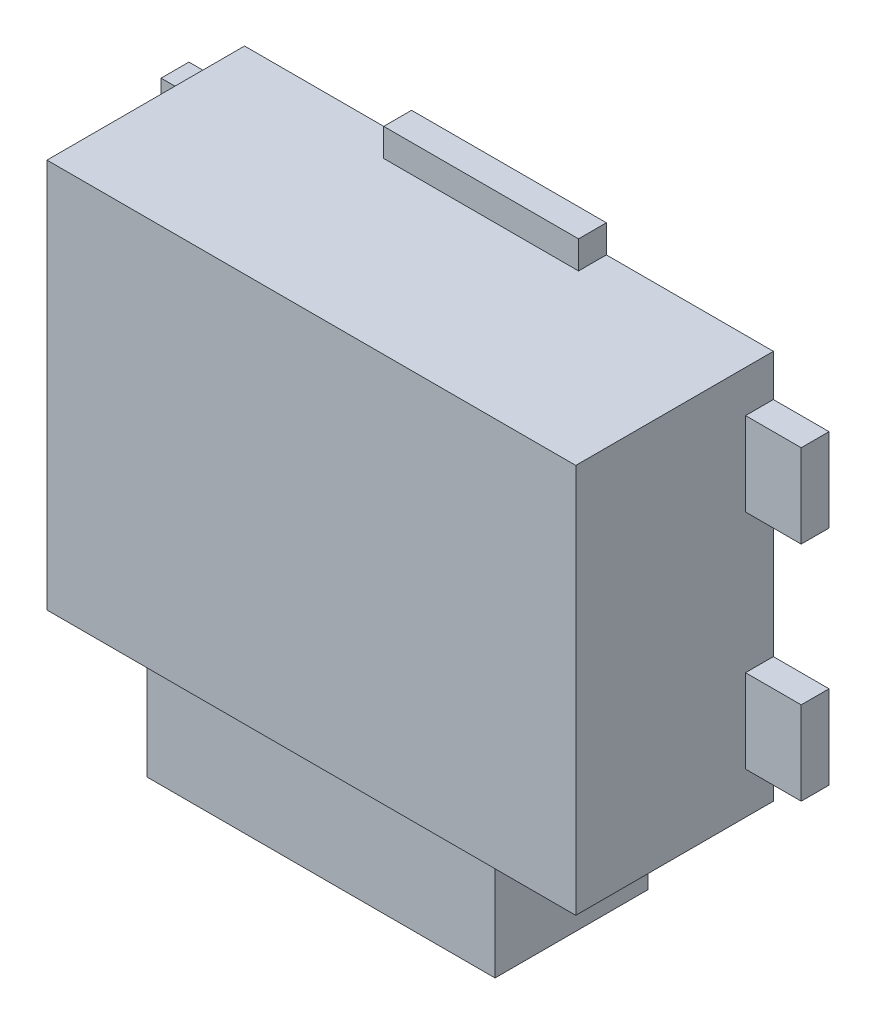
ISO-10303-21;
HEADER;
FILE_DESCRIPTION(('STEP AP214'),'2;1');
FILE_NAME('part.step','',(''),(''),'','','');
FILE_SCHEMA(('AUTOMOTIVE_DESIGN { 1 0 10303 214 1 1 1 1 }'));
ENDSEC;
DATA;
#1=APPLICATION_CONTEXT('core data for automotive mechanical design processes');
#2=APPLICATION_PROTOCOL_DEFINITION('international standard','automotive_design',2000,#1);
#3=PRODUCT_CONTEXT('',#1,'mechanical');
#4=PRODUCT('Part','Part','',(#3));
#5=PRODUCT_RELATED_PRODUCT_CATEGORY('part','',(#4));
#6=PRODUCT_DEFINITION_FORMATION('','',#4);
#7=PRODUCT_DEFINITION_CONTEXT('part definition',#1,'design');
#8=PRODUCT_DEFINITION('design','',#6,#7);
#9=PRODUCT_DEFINITION_SHAPE('','',#8);
#10=(LENGTH_UNIT() NAMED_UNIT(*) SI_UNIT(.MILLI.,.METRE.));
#11=(NAMED_UNIT(*) PLANE_ANGLE_UNIT() SI_UNIT($,.RADIAN.));
#12=(NAMED_UNIT(*) SI_UNIT($,.STERADIAN.) SOLID_ANGLE_UNIT());
#13=UNCERTAINTY_MEASURE_WITH_UNIT(LENGTH_MEASURE(1.E-05),#10,'distance_accuracy_value','');
#14=(GEOMETRIC_REPRESENTATION_CONTEXT(3) GLOBAL_UNCERTAINTY_ASSIGNED_CONTEXT((#13)) GLOBAL_UNIT_ASSIGNED_CONTEXT((#10,
#11,#12)) REPRESENTATION_CONTEXT('',''));
#15=CARTESIAN_POINT('',(0.,0.,0.));
#16=DIRECTION('',(0.,0.,1.));
#17=DIRECTION('',(1.,0.,0.));
#18=AXIS2_PLACEMENT_3D('',#15,#16,#17);
#19=CARTESIAN_POINT('',(1.25,-1.85,0.85));
#20=DIRECTION('',(0.,0.,-1.));
#21=DIRECTION('',(0.,-1.,0.));
#22=AXIS2_PLACEMENT_3D('',#19,#20,#21);
#23=PLANE('',#22);
#24=DIRECTION('',(1.,0.,0.));
#25=VECTOR('',#24,1.);
#26=CARTESIAN_POINT('',(-1.25,-0.4,0.85));
#27=LINE('',#26,#25);
#28=CARTESIAN_POINT('',(-1.25,-0.4,0.85));
#29=VERTEX_POINT('',#28);
#30=CARTESIAN_POINT('',(1.25,-0.4,0.85));
#31=VERTEX_POINT('',#30);
#32=EDGE_CURVE('E27',#29,#31,#27,.T.);
#33=ORIENTED_EDGE('',*,*,#32,.T.);
#34=DIRECTION('',(0.,-1.,0.));
#35=VECTOR('',#34,1.);
#36=CARTESIAN_POINT('',(1.25,-1.85,0.85));
#37=LINE('',#36,#35);
#38=CARTESIAN_POINT('',(1.25,-1.4,0.85));
#39=VERTEX_POINT('',#38);
#40=EDGE_CURVE('E280',#31,#39,#37,.T.);
#41=ORIENTED_EDGE('',*,*,#40,.T.);
#42=DIRECTION('',(0.,-1.,0.));
#43=VECTOR('',#42,1.);
#44=CARTESIAN_POINT('',(1.25,-1.85,0.85));
#45=LINE('',#44,#43);
#46=CARTESIAN_POINT('',(1.25,-1.85,0.85));
#47=VERTEX_POINT('',#46);
#48=EDGE_CURVE('E308',#39,#47,#45,.T.);
#49=ORIENTED_EDGE('',*,*,#48,.T.);
#50=DIRECTION('',(1.,0.,0.));
#51=VECTOR('',#50,1.);
#52=CARTESIAN_POINT('',(1.25,-1.85,0.85));
#53=LINE('',#52,#51);
#54=CARTESIAN_POINT('',(-1.25,-1.85,0.85));
#55=VERTEX_POINT('',#54);
#56=EDGE_CURVE('E11',#55,#47,#53,.T.);
#57=ORIENTED_EDGE('',*,*,#56,.F.);
#58=DIRECTION('',(0.,1.,0.));
#59=VECTOR('',#58,1.);
#60=CARTESIAN_POINT('',(-1.25,-1.85,0.85));
#61=LINE('',#60,#59);
#62=CARTESIAN_POINT('',(-1.25,-1.4,0.85));
#63=VERTEX_POINT('',#62);
#64=EDGE_CURVE('E20',#55,#63,#61,.T.);
#65=ORIENTED_EDGE('',*,*,#64,.T.);
#66=DIRECTION('',(0.,1.,0.));
#67=VECTOR('',#66,1.);
#68=CARTESIAN_POINT('',(-1.25,-1.85,0.85));
#69=LINE('',#68,#67);
#70=EDGE_CURVE('E377',#63,#29,#69,.T.);
#71=ORIENTED_EDGE('',*,*,#70,.T.);
#72=EDGE_LOOP('',(#33,#41,#49,#57,#65,#71));
#73=FACE_BOUND('',#72,.T.);
#74=ADVANCED_FACE('F16',(#73),#23,.T.);
#75=CARTESIAN_POINT('',(1.25,-1.85,0.15));
#76=DIRECTION('',(0.,1.,0.));
#77=DIRECTION('',(0.,0.,-1.));
#78=AXIS2_PLACEMENT_3D('',#75,#76,#77);
#79=PLANE('',#78);
#80=DIRECTION('',(0.,0.,1.));
#81=VECTOR('',#80,1.);
#82=CARTESIAN_POINT('',(-1.25,-1.85,0.15));
#83=LINE('',#82,#81);
#84=CARTESIAN_POINT('',(-1.25,-1.85,0.25));
#85=VERTEX_POINT('',#84);
#86=EDGE_CURVE('E428',#85,#55,#83,.T.);
#87=ORIENTED_EDGE('',*,*,#86,.T.);
#88=ORIENTED_EDGE('',*,*,#56,.T.);
#89=DIRECTION('',(0.,0.,-1.));
#90=VECTOR('',#89,1.);
#91=CARTESIAN_POINT('',(1.25,-1.85,0.15));
#92=LINE('',#91,#90);
#93=CARTESIAN_POINT('',(1.25,-1.85,0.25));
#94=VERTEX_POINT('',#93);
#95=EDGE_CURVE('E313',#47,#94,#92,.T.);
#96=ORIENTED_EDGE('',*,*,#95,.T.);
#97=DIRECTION('',(1.,0.,0.));
#98=VECTOR('',#97,1.);
#99=CARTESIAN_POINT('',(1.25,-1.85,0.25));
#100=LINE('',#99,#98);
#101=EDGE_CURVE('E395',#85,#94,#100,.T.);
#102=ORIENTED_EDGE('',*,*,#101,.F.);
#103=EDGE_LOOP('',(#87,#88,#96,#102));
#104=FACE_BOUND('',#103,.T.);
#105=ADVANCED_FACE('F1223',(#104),#79,.T.);
#106=CARTESIAN_POINT('',(-1.25,-0.4,1.35));
#107=DIRECTION('',(0.,-1.,0.));
#108=DIRECTION('',(-1.,0.,0.));
#109=AXIS2_PLACEMENT_3D('',#106,#107,#108);
#110=PLANE('',#109);
#111=ORIENTED_EDGE('',*,*,#32,.F.);
#112=DIRECTION('',(0.,0.,-1.));
#113=VECTOR('',#112,1.);
#114=CARTESIAN_POINT('',(-1.25,-0.4,1.35));
#115=LINE('',#114,#113);
#116=CARTESIAN_POINT('',(-1.25,-0.4,1.35));
#117=VERTEX_POINT('',#116);
#118=EDGE_CURVE('E373',#117,#29,#115,.T.);
#119=ORIENTED_EDGE('',*,*,#118,.F.);
#120=DIRECTION('',(-1.,0.,0.));
#121=VECTOR('',#120,1.);
#122=CARTESIAN_POINT('',(-1.25,-0.4,1.35));
#123=LINE('',#122,#121);
#124=CARTESIAN_POINT('',(1.25,-0.4,1.35));
#125=VERTEX_POINT('',#124);
#126=EDGE_CURVE('E42',#125,#117,#123,.T.);
#127=ORIENTED_EDGE('',*,*,#126,.F.);
#128=DIRECTION('',(0.,0.,1.));
#129=VECTOR('',#128,1.);
#130=CARTESIAN_POINT('',(1.25,-0.4,1.35));
#131=LINE('',#130,#129);
#132=EDGE_CURVE('E284',#31,#125,#131,.T.);
#133=ORIENTED_EDGE('',*,*,#132,.F.);
#134=EDGE_LOOP('',(#111,#119,#127,#133));
#135=FACE_BOUND('',#134,.T.);
#136=ADVANCED_FACE('F1218',(#135),#110,.F.);
#137=CARTESIAN_POINT('',(1.25,-0.4,0.25));
#138=DIRECTION('',(0.,0.,-1.));
#139=DIRECTION('',(0.,-1.,0.));
#140=AXIS2_PLACEMENT_3D('',#137,#138,#139);
#141=PLANE('',#140);
#142=DIRECTION('',(1.,0.,0.));
#143=VECTOR('',#142,1.);
#144=CARTESIAN_POINT('',(-1.25,-2.15,0.25));
#145=LINE('',#144,#143);
#146=CARTESIAN_POINT('',(-1.25,-2.15,0.25));
#147=VERTEX_POINT('',#146);
#148=CARTESIAN_POINT('',(1.25,-2.15,0.25));
#149=VERTEX_POINT('',#148);
#150=EDGE_CURVE('E456',#147,#149,#145,.T.);
#151=ORIENTED_EDGE('',*,*,#150,.F.);
#152=DIRECTION('',(0.,1.,0.));
#153=VECTOR('',#152,1.);
#154=CARTESIAN_POINT('',(-1.25,-0.4,0.25));
#155=LINE('',#154,#153);
#156=EDGE_CURVE('E423',#147,#85,#155,.T.);
#157=ORIENTED_EDGE('',*,*,#156,.T.);
#158=ORIENTED_EDGE('',*,*,#101,.T.);
#159=DIRECTION('',(0.,-1.,0.));
#160=VECTOR('',#159,1.);
#161=CARTESIAN_POINT('',(1.25,-0.4,0.25));
#162=LINE('',#161,#160);
#163=EDGE_CURVE('E407',#94,#149,#162,.T.);
#164=ORIENTED_EDGE('',*,*,#163,.T.);
#165=EDGE_LOOP('',(#151,#157,#158,#164));
#166=FACE_BOUND('',#165,.T.);
#167=ADVANCED_FACE('F1222',(#166),#141,.T.);
#168=CARTESIAN_POINT('',(-1.25,-1.4,1.35));
#169=DIRECTION('',(0.,0.,-1.));
#170=DIRECTION('',(0.,-1.,0.));
#171=AXIS2_PLACEMENT_3D('',#168,#169,#170);
#172=PLANE('',#171);
#173=DIRECTION('',(-1.,0.,0.));
#174=VECTOR('',#173,1.);
#175=CARTESIAN_POINT('',(-1.25,0.6,1.35));
#176=LINE('',#175,#174);
#177=CARTESIAN_POINT('',(1.25,0.6,1.35));
#178=VERTEX_POINT('',#177);
#179=CARTESIAN_POINT('',(-1.25,0.6,1.35));
#180=VERTEX_POINT('',#179);
#181=EDGE_CURVE('E285',#178,#180,#176,.T.);
#182=ORIENTED_EDGE('',*,*,#181,.F.);
#183=DIRECTION('',(0.,1.,0.));
#184=VECTOR('',#183,1.);
#185=CARTESIAN_POINT('',(1.25,-1.4,1.35));
#186=LINE('',#185,#184);
#187=EDGE_CURVE('E267',#125,#178,#186,.T.);
#188=ORIENTED_EDGE('',*,*,#187,.F.);
#189=ORIENTED_EDGE('',*,*,#126,.T.);
#190=DIRECTION('',(0.,1.,0.));
#191=VECTOR('',#190,1.);
#192=CARTESIAN_POINT('',(-1.25,-1.4,1.35));
#193=LINE('',#192,#191);
#194=EDGE_CURVE('E466',#117,#180,#193,.T.);
#195=ORIENTED_EDGE('',*,*,#194,.T.);
#196=EDGE_LOOP('',(#182,#188,#189,#195));
#197=FACE_BOUND('',#196,.T.);
#198=ADVANCED_FACE('F780',(#197),#172,.T.);
#199=CARTESIAN_POINT('',(-2.3,0.5,0.));
#200=DIRECTION('',(-1.,0.,0.));
#201=DIRECTION('',(0.,0.,1.));
#202=AXIS2_PLACEMENT_3D('',#199,#200,#201);
#203=PLANE('',#202);
#204=DIRECTION('',(0.,0.,1.));
#205=VECTOR('',#204,1.);
#206=CARTESIAN_POINT('',(-2.3,1.1,0.));
#207=LINE('',#206,#205);
#208=CARTESIAN_POINT('',(-2.3,1.1,0.));
#209=VERTEX_POINT('',#208);
#210=CARTESIAN_POINT('',(-2.3,1.1,0.2));
#211=VERTEX_POINT('',#210);
#212=EDGE_CURVE('E378',#209,#211,#207,.T.);
#213=ORIENTED_EDGE('',*,*,#212,.F.);
#214=DIRECTION('',(0.,-1.,0.));
#215=VECTOR('',#214,1.);
#216=CARTESIAN_POINT('',(-2.3,0.5,0.));
#217=LINE('',#216,#215);
#218=CARTESIAN_POINT('',(-2.3,0.5,0.));
#219=VERTEX_POINT('',#218);
#220=EDGE_CURVE('E422',#209,#219,#217,.T.);
#221=ORIENTED_EDGE('',*,*,#220,.T.);
#222=DIRECTION('',(0.,0.,-1.));
#223=VECTOR('',#222,1.);
#224=CARTESIAN_POINT('',(-2.3,0.5,0.));
#225=LINE('',#224,#223);
#226=CARTESIAN_POINT('',(-2.3,0.5,0.2));
#227=VERTEX_POINT('',#226);
#228=EDGE_CURVE('E354',#227,#219,#225,.T.);
#229=ORIENTED_EDGE('',*,*,#228,.F.);
#230=DIRECTION('',(0.,-1.,0.));
#231=VECTOR('',#230,1.);
#232=CARTESIAN_POINT('',(-2.3,1.1,0.2));
#233=LINE('',#232,#231);
#234=EDGE_CURVE('E353',#211,#227,#233,.T.);
#235=ORIENTED_EDGE('',*,*,#234,.F.);
#236=EDGE_LOOP('',(#213,#221,#229,#235));
#237=FACE_BOUND('',#236,.T.);
#238=ADVANCED_FACE('F1149',(#237),#203,.T.);
#239=CARTESIAN_POINT('',(-2.299999999999,-1.1,0.));
#240=DIRECTION('',(-1.,0.,0.));
#241=DIRECTION('',(0.,0.,1.));
#242=AXIS2_PLACEMENT_3D('',#239,#240,#241);
#243=PLANE('',#242);
#244=DIRECTION('',(0.,0.,1.));
#245=VECTOR('',#244,1.);
#246=CARTESIAN_POINT('',(-2.299999999999,-0.5,0.));
#247=LINE('',#246,#245);
#248=CARTESIAN_POINT('',(-2.299999999999,-0.5,0.));
#249=VERTEX_POINT('',#248);
#250=CARTESIAN_POINT('',(-2.299999999999,-0.5,0.2));
#251=VERTEX_POINT('',#250);
#252=EDGE_CURVE('E334',#249,#251,#247,.T.);
#253=ORIENTED_EDGE('',*,*,#252,.F.);
#254=DIRECTION('',(0.,-1.,0.));
#255=VECTOR('',#254,1.);
#256=CARTESIAN_POINT('',(-2.299999999999,-1.1,0.));
#257=LINE('',#256,#255);
#258=CARTESIAN_POINT('',(-2.299999999999,-1.1,0.));
#259=VERTEX_POINT('',#258);
#260=EDGE_CURVE('E383',#249,#259,#257,.T.);
#261=ORIENTED_EDGE('',*,*,#260,.T.);
#262=DIRECTION('',(0.,0.,-1.));
#263=VECTOR('',#262,1.);
#264=CARTESIAN_POINT('',(-2.299999999999,-1.1,0.));
#265=LINE('',#264,#263);
#266=CARTESIAN_POINT('',(-2.299999999999,-1.1,0.2));
#267=VERTEX_POINT('',#266);
#268=EDGE_CURVE('E448',#267,#259,#265,.T.);
#269=ORIENTED_EDGE('',*,*,#268,.F.);
#270=DIRECTION('',(0.,-1.,0.));
#271=VECTOR('',#270,1.);
#272=CARTESIAN_POINT('',(-2.299999999999,-0.5,0.2));
#273=LINE('',#272,#271);
#274=EDGE_CURVE('E331',#251,#267,#273,.T.);
#275=ORIENTED_EDGE('',*,*,#274,.F.);
#276=EDGE_LOOP('',(#253,#261,#269,#275));
#277=FACE_BOUND('',#276,.T.);
#278=ADVANCED_FACE('F1145',(#277),#243,.T.);
#279=CARTESIAN_POINT('',(-1.25,-2.15,1.35));
#280=DIRECTION('',(0.,-1.,0.));
#281=DIRECTION('',(-1.,0.,0.));
#282=AXIS2_PLACEMENT_3D('',#279,#280,#281);
#283=PLANE('',#282);
#284=DIRECTION('',(0.,0.,1.));
#285=VECTOR('',#284,1.);
#286=CARTESIAN_POINT('',(1.25,-2.15,1.35));
#287=LINE('',#286,#285);
#288=CARTESIAN_POINT('',(1.25,-2.15,1.35));
#289=VERTEX_POINT('',#288);
#290=EDGE_CURVE('E411',#149,#289,#287,.T.);
#291=ORIENTED_EDGE('',*,*,#290,.T.);
#292=DIRECTION('',(1.,0.,0.));
#293=VECTOR('',#292,1.);
#294=CARTESIAN_POINT('',(-1.25,-2.15,1.35));
#295=LINE('',#294,#293);
#296=CARTESIAN_POINT('',(-1.25,-2.15,1.35));
#297=VERTEX_POINT('',#296);
#298=EDGE_CURVE('E388',#297,#289,#295,.T.);
#299=ORIENTED_EDGE('',*,*,#298,.F.);
#300=DIRECTION('',(0.,0.,1.));
#301=VECTOR('',#300,1.);
#302=CARTESIAN_POINT('',(-1.25,-2.15,0.25));
#303=LINE('',#302,#301);
#304=EDGE_CURVE('E427',#147,#297,#303,.T.);
#305=ORIENTED_EDGE('',*,*,#304,.F.);
#306=ORIENTED_EDGE('',*,*,#150,.T.);
#307=EDGE_LOOP('',(#291,#299,#305,#306));
#308=FACE_BOUND('',#307,.T.);
#309=ADVANCED_FACE('F645',(#308),#283,.T.);
#310=CARTESIAN_POINT('',(1.25,-1.4,1.35));
#311=DIRECTION('',(-1.,0.,0.));
#312=DIRECTION('',(0.,0.,1.));
#313=AXIS2_PLACEMENT_3D('',#310,#311,#312);
#314=PLANE('',#313);
#315=DIRECTION('',(0.,0.,1.));
#316=VECTOR('',#315,1.);
#317=CARTESIAN_POINT('',(1.25,-1.4,1.35));
#318=LINE('',#317,#316);
#319=CARTESIAN_POINT('',(1.25,-1.4,0.8));
#320=VERTEX_POINT('',#319);
#321=EDGE_CURVE('E295',#320,#39,#318,.T.);
#322=ORIENTED_EDGE('',*,*,#321,.T.);
#323=ORIENTED_EDGE('',*,*,#40,.F.);
#324=ORIENTED_EDGE('',*,*,#132,.T.);
#325=ORIENTED_EDGE('',*,*,#187,.T.);
#326=DIRECTION('',(0.,0.,1.));
#327=VECTOR('',#326,1.);
#328=CARTESIAN_POINT('',(1.25,0.6,1.35));
#329=LINE('',#328,#327);
#330=CARTESIAN_POINT('',(1.25,0.6,0.8));
#331=VERTEX_POINT('',#330);
#332=EDGE_CURVE('E462',#331,#178,#329,.T.);
#333=ORIENTED_EDGE('',*,*,#332,.F.);
#334=DIRECTION('',(0.,1.,0.));
#335=VECTOR('',#334,1.);
#336=CARTESIAN_POINT('',(1.25,-1.4,0.8));
#337=LINE('',#336,#335);
#338=EDGE_CURVE('E367',#320,#331,#337,.T.);
#339=ORIENTED_EDGE('',*,*,#338,.F.);
#340=EDGE_LOOP('',(#322,#323,#324,#325,#333,#339));
#341=FACE_BOUND('',#340,.T.);
#342=ADVANCED_FACE('F777',(#341),#314,.T.);
#343=CARTESIAN_POINT('',(-1.25,0.6,1.35));
#344=DIRECTION('',(0.,-1.,0.));
#345=DIRECTION('',(0.,0.,-1.));
#346=AXIS2_PLACEMENT_3D('',#343,#344,#345);
#347=PLANE('',#346);
#348=ORIENTED_EDGE('',*,*,#332,.T.);
#349=ORIENTED_EDGE('',*,*,#181,.T.);
#350=DIRECTION('',(0.,0.,1.));
#351=VECTOR('',#350,1.);
#352=CARTESIAN_POINT('',(-1.25,0.6,0.8));
#353=LINE('',#352,#351);
#354=CARTESIAN_POINT('',(-1.25,0.6,0.8));
#355=VERTEX_POINT('',#354);
#356=EDGE_CURVE('E508',#355,#180,#353,.T.);
#357=ORIENTED_EDGE('',*,*,#356,.F.);
#358=DIRECTION('',(-1.,0.,0.));
#359=VECTOR('',#358,1.);
#360=CARTESIAN_POINT('',(1.25,0.6,0.8));
#361=LINE('',#360,#359);
#362=EDGE_CURVE('E371',#331,#355,#361,.T.);
#363=ORIENTED_EDGE('',*,*,#362,.F.);
#364=EDGE_LOOP('',(#348,#349,#357,#363));
#365=FACE_BOUND('',#364,.T.);
#366=ADVANCED_FACE('F783',(#365),#347,.T.);
#367=CARTESIAN_POINT('',(-1.25,-1.4,0.8));
#368=DIRECTION('',(1.,0.,0.));
#369=DIRECTION('',(0.,1.,0.));
#370=AXIS2_PLACEMENT_3D('',#367,#368,#369);
#371=PLANE('',#370);
#372=ORIENTED_EDGE('',*,*,#118,.T.);
#373=ORIENTED_EDGE('',*,*,#70,.F.);
#374=DIRECTION('',(0.,0.,-1.));
#375=VECTOR('',#374,1.);
#376=CARTESIAN_POINT('',(-1.25,-1.4,0.8));
#377=LINE('',#376,#375);
#378=CARTESIAN_POINT('',(-1.25,-1.4,0.8));
#379=VERTEX_POINT('',#378);
#380=EDGE_CURVE('E269',#63,#379,#377,.T.);
#381=ORIENTED_EDGE('',*,*,#380,.T.);
#382=DIRECTION('',(0.,-1.,0.));
#383=VECTOR('',#382,1.);
#384=CARTESIAN_POINT('',(-1.25,-1.4,0.8));
#385=LINE('',#384,#383);
#386=EDGE_CURVE('E372',#355,#379,#385,.T.);
#387=ORIENTED_EDGE('',*,*,#386,.F.);
#388=ORIENTED_EDGE('',*,*,#356,.T.);
#389=ORIENTED_EDGE('',*,*,#194,.F.);
#390=EDGE_LOOP('',(#372,#373,#381,#387,#388,#389));
#391=FACE_BOUND('',#390,.T.);
#392=ADVANCED_FACE('F1205',(#391),#371,.T.);
#393=CARTESIAN_POINT('',(2.3,-0.5,0.));
#394=DIRECTION('',(1.,0.,0.));
#395=DIRECTION('',(0.,1.,0.));
#396=AXIS2_PLACEMENT_3D('',#393,#394,#395);
#397=PLANE('',#396);
#398=DIRECTION('',(0.,0.,1.));
#399=VECTOR('',#398,1.);
#400=CARTESIAN_POINT('',(2.3,-1.1,0.));
#401=LINE('',#400,#399);
#402=CARTESIAN_POINT('',(2.3,-1.1,0.));
#403=VERTEX_POINT('',#402);
#404=CARTESIAN_POINT('',(2.3,-1.1,0.2));
#405=VERTEX_POINT('',#404);
#406=EDGE_CURVE('E329',#403,#405,#401,.T.);
#407=ORIENTED_EDGE('',*,*,#406,.F.);
#408=DIRECTION('',(0.,1.,0.));
#409=VECTOR('',#408,1.);
#410=CARTESIAN_POINT('',(2.3,-0.5,0.));
#411=LINE('',#410,#409);
#412=CARTESIAN_POINT('',(2.3,-0.5,0.));
#413=VERTEX_POINT('',#412);
#414=EDGE_CURVE('E317',#403,#413,#411,.T.);
#415=ORIENTED_EDGE('',*,*,#414,.T.);
#416=DIRECTION('',(0.,0.,-1.));
#417=VECTOR('',#416,1.);
#418=CARTESIAN_POINT('',(2.3,-0.5,0.));
#419=LINE('',#418,#417);
#420=CARTESIAN_POINT('',(2.3,-0.5,0.2));
#421=VERTEX_POINT('',#420);
#422=EDGE_CURVE('E403',#421,#413,#419,.T.);
#423=ORIENTED_EDGE('',*,*,#422,.F.);
#424=DIRECTION('',(0.,1.,0.));
#425=VECTOR('',#424,1.);
#426=CARTESIAN_POINT('',(2.3,-0.5,0.2));
#427=LINE('',#426,#425);
#428=EDGE_CURVE('E330',#405,#421,#427,.T.);
#429=ORIENTED_EDGE('',*,*,#428,.F.);
#430=EDGE_LOOP('',(#407,#415,#423,#429));
#431=FACE_BOUND('',#430,.T.);
#432=ADVANCED_FACE('F1209',(#431),#397,.T.);
#433=CARTESIAN_POINT('',(2.3,1.1,0.));
#434=DIRECTION('',(1.,0.,0.));
#435=DIRECTION('',(0.,1.,0.));
#436=AXIS2_PLACEMENT_3D('',#433,#434,#435);
#437=PLANE('',#436);
#438=DIRECTION('',(0.,0.,1.));
#439=VECTOR('',#438,1.);
#440=CARTESIAN_POINT('',(2.3,0.5,0.));
#441=LINE('',#440,#439);
#442=CARTESIAN_POINT('',(2.3,0.5,0.));
#443=VERTEX_POINT('',#442);
#444=CARTESIAN_POINT('',(2.3,0.5,0.2));
#445=VERTEX_POINT('',#444);
#446=EDGE_CURVE('E404',#443,#445,#441,.T.);
#447=ORIENTED_EDGE('',*,*,#446,.F.);
#448=DIRECTION('',(0.,1.,0.));
#449=VECTOR('',#448,1.);
#450=CARTESIAN_POINT('',(2.3,1.1,0.));
#451=LINE('',#450,#449);
#452=CARTESIAN_POINT('',(2.3,1.1,0.));
#453=VERTEX_POINT('',#452);
#454=EDGE_CURVE('E314',#443,#453,#451,.T.);
#455=ORIENTED_EDGE('',*,*,#454,.T.);
#456=DIRECTION('',(0.,0.,-1.));
#457=VECTOR('',#456,1.);
#458=CARTESIAN_POINT('',(2.3,1.1,0.));
#459=LINE('',#458,#457);
#460=CARTESIAN_POINT('',(2.3,1.1,0.2));
#461=VERTEX_POINT('',#460);
#462=EDGE_CURVE('E596',#461,#453,#459,.T.);
#463=ORIENTED_EDGE('',*,*,#462,.F.);
#464=DIRECTION('',(0.,1.,0.));
#465=VECTOR('',#464,1.);
#466=CARTESIAN_POINT('',(2.3,1.1,0.2));
#467=LINE('',#466,#465);
#468=EDGE_CURVE('E336',#445,#461,#467,.T.);
#469=ORIENTED_EDGE('',*,*,#468,.F.);
#470=EDGE_LOOP('',(#447,#455,#463,#469));
#471=FACE_BOUND('',#470,.T.);
#472=ADVANCED_FACE('F1259',(#471),#437,.T.);
#473=CARTESIAN_POINT('',(-0.7,1.6,0.));
#474=DIRECTION('',(0.,1.,0.));
#475=DIRECTION('',(1.,0.,0.));
#476=AXIS2_PLACEMENT_3D('',#473,#474,#475);
#477=PLANE('',#476);
#478=DIRECTION('',(0.,0.,1.));
#479=VECTOR('',#478,1.);
#480=CARTESIAN_POINT('',(0.7,1.6,0.));
#481=LINE('',#480,#479);
#482=CARTESIAN_POINT('',(0.7,1.6,0.));
#483=VERTEX_POINT('',#482);
#484=CARTESIAN_POINT('',(0.7,1.6,0.2));
#485=VERTEX_POINT('',#484);
#486=EDGE_CURVE('E471',#483,#485,#481,.T.);
#487=ORIENTED_EDGE('',*,*,#486,.F.);
#488=DIRECTION('',(-1.,0.,0.));
#489=VECTOR('',#488,1.);
#490=CARTESIAN_POINT('',(-0.7,1.6,0.));
#491=LINE('',#490,#489);
#492=CARTESIAN_POINT('',(-0.7,1.6,0.));
#493=VERTEX_POINT('',#492);
#494=EDGE_CURVE('E318',#483,#493,#491,.T.);
#495=ORIENTED_EDGE('',*,*,#494,.T.);
#496=DIRECTION('',(0.,0.,1.));
#497=VECTOR('',#496,1.);
#498=CARTESIAN_POINT('',(-0.7,1.6,0.));
#499=LINE('',#498,#497);
#500=CARTESIAN_POINT('',(-0.7,1.6,0.2));
#501=VERTEX_POINT('',#500);
#502=EDGE_CURVE('E290',#493,#501,#499,.T.);
#503=ORIENTED_EDGE('',*,*,#502,.T.);
#504=DIRECTION('',(-1.,0.,0.));
#505=VECTOR('',#504,1.);
#506=CARTESIAN_POINT('',(-0.7,1.6,0.2));
#507=LINE('',#506,#505);
#508=EDGE_CURVE('E323',#485,#501,#507,.T.);
#509=ORIENTED_EDGE('',*,*,#508,.F.);
#510=EDGE_LOOP('',(#487,#495,#503,#509));
#511=FACE_BOUND('',#510,.T.);
#512=ADVANCED_FACE('F1169',(#511),#477,.T.);
#513=CARTESIAN_POINT('',(-2.3,1.1,0.));
#514=DIRECTION('',(0.,1.,0.));
#515=DIRECTION('',(1.,0.,0.));
#516=AXIS2_PLACEMENT_3D('',#513,#514,#515);
#517=PLANE('',#516);
#518=DIRECTION('',(-1.,0.,0.));
#519=VECTOR('',#518,1.);
#520=CARTESIAN_POINT('',(-2.3,1.1,0.2));
#521=LINE('',#520,#519);
#522=CARTESIAN_POINT('',(-1.9,1.1,0.2));
#523=VERTEX_POINT('',#522);
#524=EDGE_CURVE('E349',#523,#211,#521,.T.);
#525=ORIENTED_EDGE('',*,*,#524,.F.);
#526=DIRECTION('',(0.,0.,1.));
#527=VECTOR('',#526,1.);
#528=CARTESIAN_POINT('',(-1.9,1.1,0.));
#529=LINE('',#528,#527);
#530=CARTESIAN_POINT('',(-1.9,1.1,0.));
#531=VERTEX_POINT('',#530);
#532=EDGE_CURVE('E278',#531,#523,#529,.T.);
#533=ORIENTED_EDGE('',*,*,#532,.F.);
#534=DIRECTION('',(-1.,0.,0.));
#535=VECTOR('',#534,1.);
#536=CARTESIAN_POINT('',(-2.3,1.1,0.));
#537=LINE('',#536,#535);
#538=EDGE_CURVE('E418',#531,#209,#537,.T.);
#539=ORIENTED_EDGE('',*,*,#538,.T.);
#540=ORIENTED_EDGE('',*,*,#212,.T.);
#541=EDGE_LOOP('',(#525,#533,#539,#540));
#542=FACE_BOUND('',#541,.T.);
#543=ADVANCED_FACE('F1165',(#542),#517,.T.);
#544=CARTESIAN_POINT('',(-2.3,1.1,0.2));
#545=DIRECTION('',(0.,0.,1.));
#546=DIRECTION('',(1.,0.,0.));
#547=AXIS2_PLACEMENT_3D('',#544,#545,#546);
#548=PLANE('',#547);
#549=DIRECTION('',(-1.,0.,0.));
#550=VECTOR('',#549,1.);
#551=CARTESIAN_POINT('',(-1.6,0.5,0.2));
#552=LINE('',#551,#550);
#553=CARTESIAN_POINT('',(-1.9,0.5,0.2));
#554=VERTEX_POINT('',#553);
#555=EDGE_CURVE('E392',#554,#227,#552,.T.);
#556=ORIENTED_EDGE('',*,*,#555,.F.);
#557=DIRECTION('',(0.,-1.,0.));
#558=VECTOR('',#557,1.);
#559=CARTESIAN_POINT('',(-1.9,-1.4,0.2));
#560=LINE('',#559,#558);
#561=EDGE_CURVE('E417',#523,#554,#560,.T.);
#562=ORIENTED_EDGE('',*,*,#561,.F.);
#563=ORIENTED_EDGE('',*,*,#524,.T.);
#564=ORIENTED_EDGE('',*,*,#234,.T.);
#565=EDGE_LOOP('',(#556,#562,#563,#564));
#566=FACE_BOUND('',#565,.T.);
#567=ADVANCED_FACE('F1117',(#566),#548,.T.);
#568=CARTESIAN_POINT('',(-1.6,0.5,0.));
#569=DIRECTION('',(0.,-1.,0.));
#570=DIRECTION('',(0.,0.,-1.));
#571=AXIS2_PLACEMENT_3D('',#568,#569,#570);
#572=PLANE('',#571);
#573=ORIENTED_EDGE('',*,*,#555,.T.);
#574=ORIENTED_EDGE('',*,*,#228,.T.);
#575=DIRECTION('',(1.,0.,0.));
#576=VECTOR('',#575,1.);
#577=CARTESIAN_POINT('',(-1.6,0.5,0.));
#578=LINE('',#577,#576);
#579=CARTESIAN_POINT('',(-1.9,0.5,0.));
#580=VERTEX_POINT('',#579);
#581=EDGE_CURVE('E435',#219,#580,#578,.T.);
#582=ORIENTED_EDGE('',*,*,#581,.T.);
#583=DIRECTION('',(0.,0.,-1.));
#584=VECTOR('',#583,1.);
#585=CARTESIAN_POINT('',(-1.9,0.5,0.));
#586=LINE('',#585,#584);
#587=EDGE_CURVE('E530',#554,#580,#586,.T.);
#588=ORIENTED_EDGE('',*,*,#587,.F.);
#589=EDGE_LOOP('',(#573,#574,#582,#588));
#590=FACE_BOUND('',#589,.T.);
#591=ADVANCED_FACE('F1112',(#590),#572,.T.);
#592=CARTESIAN_POINT('',(-2.299999999999,-0.5,0.));
#593=DIRECTION('',(0.,1.,0.));
#594=DIRECTION('',(1.,0.,0.));
#595=AXIS2_PLACEMENT_3D('',#592,#593,#594);
#596=PLANE('',#595);
#597=DIRECTION('',(-1.,0.,0.));
#598=VECTOR('',#597,1.);
#599=CARTESIAN_POINT('',(-2.299999999999,-0.5,0.2));
#600=LINE('',#599,#598);
#601=CARTESIAN_POINT('',(-1.9,-0.5,0.2));
#602=VERTEX_POINT('',#601);
#603=EDGE_CURVE('E335',#602,#251,#600,.T.);
#604=ORIENTED_EDGE('',*,*,#603,.F.);
#605=DIRECTION('',(0.,0.,1.));
#606=VECTOR('',#605,1.);
#607=CARTESIAN_POINT('',(-1.9,-0.5,0.));
#608=LINE('',#607,#606);
#609=CARTESIAN_POINT('',(-1.9,-0.5,0.));
#610=VERTEX_POINT('',#609);
#611=EDGE_CURVE('E291',#610,#602,#608,.T.);
#612=ORIENTED_EDGE('',*,*,#611,.F.);
#613=DIRECTION('',(-1.,0.,0.));
#614=VECTOR('',#613,1.);
#615=CARTESIAN_POINT('',(-2.299999999999,-0.5,0.));
#616=LINE('',#615,#614);
#617=EDGE_CURVE('E431',#610,#249,#616,.T.);
#618=ORIENTED_EDGE('',*,*,#617,.T.);
#619=ORIENTED_EDGE('',*,*,#252,.T.);
#620=EDGE_LOOP('',(#604,#612,#618,#619));
#621=FACE_BOUND('',#620,.T.);
#622=ADVANCED_FACE('F1116',(#621),#596,.T.);
#623=CARTESIAN_POINT('',(-2.299999999999,-0.5,0.2));
#624=DIRECTION('',(0.,0.,1.));
#625=DIRECTION('',(1.,0.,0.));
#626=AXIS2_PLACEMENT_3D('',#623,#624,#625);
#627=PLANE('',#626);
#628=DIRECTION('',(-1.,0.,0.));
#629=VECTOR('',#628,1.);
#630=CARTESIAN_POINT('',(-1.599999999999,-1.1,0.2));
#631=LINE('',#630,#629);
#632=CARTESIAN_POINT('',(-1.9,-1.1,0.2));
#633=VERTEX_POINT('',#632);
#634=EDGE_CURVE('E130',#633,#267,#631,.T.);
#635=ORIENTED_EDGE('',*,*,#634,.F.);
#636=DIRECTION('',(0.,-1.,0.));
#637=VECTOR('',#636,1.);
#638=CARTESIAN_POINT('',(-1.9,-1.4,0.2));
#639=LINE('',#638,#637);
#640=EDGE_CURVE('E300',#602,#633,#639,.T.);
#641=ORIENTED_EDGE('',*,*,#640,.F.);
#642=ORIENTED_EDGE('',*,*,#603,.T.);
#643=ORIENTED_EDGE('',*,*,#274,.T.);
#644=EDGE_LOOP('',(#635,#641,#642,#643));
#645=FACE_BOUND('',#644,.T.);
#646=ADVANCED_FACE('F1325',(#645),#627,.T.);
#647=CARTESIAN_POINT('',(-1.599999999999,-1.1,0.));
#648=DIRECTION('',(0.,-1.,0.));
#649=DIRECTION('',(0.,0.,-1.));
#650=AXIS2_PLACEMENT_3D('',#647,#648,#649);
#651=PLANE('',#650);
#652=ORIENTED_EDGE('',*,*,#634,.T.);
#653=ORIENTED_EDGE('',*,*,#268,.T.);
#654=DIRECTION('',(1.,0.,0.));
#655=VECTOR('',#654,1.);
#656=CARTESIAN_POINT('',(-1.599999999999,-1.1,0.));
#657=LINE('',#656,#655);
#658=CARTESIAN_POINT('',(-1.9,-1.1,0.));
#659=VERTEX_POINT('',#658);
#660=EDGE_CURVE('E116',#259,#659,#657,.T.);
#661=ORIENTED_EDGE('',*,*,#660,.T.);
#662=DIRECTION('',(0.,0.,-1.));
#663=VECTOR('',#662,1.);
#664=CARTESIAN_POINT('',(-1.9,-1.1,0.));
#665=LINE('',#664,#663);
#666=EDGE_CURVE('E345',#633,#659,#665,.T.);
#667=ORIENTED_EDGE('',*,*,#666,.F.);
#668=EDGE_LOOP('',(#652,#653,#661,#667));
#669=FACE_BOUND('',#668,.T.);
#670=ADVANCED_FACE('F1200',(#669),#651,.T.);
#671=CARTESIAN_POINT('',(-1.9,1.4,0.));
#672=DIRECTION('',(0.,0.,1.));
#673=DIRECTION('',(1.,0.,0.));
#674=AXIS2_PLACEMENT_3D('',#671,#672,#673);
#675=PLANE('',#674);
#676=DIRECTION('',(-1.,0.,0.));
#677=VECTOR('',#676,1.);
#678=CARTESIAN_POINT('',(-1.9,1.4,0.));
#679=LINE('',#678,#677);
#680=CARTESIAN_POINT('',(-0.7,1.4,0.));
#681=VERTEX_POINT('',#680);
#682=CARTESIAN_POINT('',(-1.9,1.4,0.));
#683=VERTEX_POINT('',#682);
#684=EDGE_CURVE('E439',#681,#683,#679,.T.);
#685=ORIENTED_EDGE('',*,*,#684,.F.);
#686=DIRECTION('',(0.,-1.,0.));
#687=VECTOR('',#686,1.);
#688=CARTESIAN_POINT('',(-0.7,1.6,0.));
#689=LINE('',#688,#687);
#690=EDGE_CURVE('E324',#493,#681,#689,.T.);
#691=ORIENTED_EDGE('',*,*,#690,.F.);
#692=ORIENTED_EDGE('',*,*,#494,.F.);
#693=DIRECTION('',(0.,1.,0.));
#694=VECTOR('',#693,1.);
#695=CARTESIAN_POINT('',(0.7,1.6,0.));
#696=LINE('',#695,#694);
#697=CARTESIAN_POINT('',(0.7,1.4,0.));
#698=VERTEX_POINT('',#697);
#699=EDGE_CURVE('E467',#698,#483,#696,.T.);
#700=ORIENTED_EDGE('',*,*,#699,.F.);
#701=DIRECTION('',(-1.,0.,0.));
#702=VECTOR('',#701,1.);
#703=CARTESIAN_POINT('',(-1.9,1.4,0.));
#704=LINE('',#703,#702);
#705=CARTESIAN_POINT('',(1.9,1.4,0.));
#706=VERTEX_POINT('',#705);
#707=EDGE_CURVE('E360',#706,#698,#704,.T.);
#708=ORIENTED_EDGE('',*,*,#707,.F.);
#709=DIRECTION('',(0.,1.,0.));
#710=VECTOR('',#709,1.);
#711=CARTESIAN_POINT('',(1.9,1.4,0.));
#712=LINE('',#711,#710);
#713=CARTESIAN_POINT('',(1.9,1.1,0.));
#714=VERTEX_POINT('',#713);
#715=EDGE_CURVE('E239',#714,#706,#712,.T.);
#716=ORIENTED_EDGE('',*,*,#715,.F.);
#717=DIRECTION('',(-1.,0.,0.));
#718=VECTOR('',#717,1.);
#719=CARTESIAN_POINT('',(1.6,1.1,0.));
#720=LINE('',#719,#718);
#721=EDGE_CURVE('E593',#453,#714,#720,.T.);
#722=ORIENTED_EDGE('',*,*,#721,.F.);
#723=ORIENTED_EDGE('',*,*,#454,.F.);
#724=DIRECTION('',(1.,0.,0.));
#725=VECTOR('',#724,1.);
#726=CARTESIAN_POINT('',(2.3,0.5,0.));
#727=LINE('',#726,#725);
#728=CARTESIAN_POINT('',(1.9,0.5,0.));
#729=VERTEX_POINT('',#728);
#730=EDGE_CURVE('E340',#729,#443,#727,.T.);
#731=ORIENTED_EDGE('',*,*,#730,.F.);
#732=DIRECTION('',(0.,1.,0.));
#733=VECTOR('',#732,1.);
#734=CARTESIAN_POINT('',(1.9,1.4,0.));
#735=LINE('',#734,#733);
#736=CARTESIAN_POINT('',(1.9,-0.5,0.));
#737=VERTEX_POINT('',#736);
#738=EDGE_CURVE('E307',#737,#729,#735,.T.);
#739=ORIENTED_EDGE('',*,*,#738,.F.);
#740=DIRECTION('',(-1.,0.,0.));
#741=VECTOR('',#740,1.);
#742=CARTESIAN_POINT('',(1.6,-0.5,0.));
#743=LINE('',#742,#741);
#744=EDGE_CURVE('E494',#413,#737,#743,.T.);
#745=ORIENTED_EDGE('',*,*,#744,.F.);
#746=ORIENTED_EDGE('',*,*,#414,.F.);
#747=DIRECTION('',(1.,0.,0.));
#748=VECTOR('',#747,1.);
#749=CARTESIAN_POINT('',(2.3,-1.1,0.));
#750=LINE('',#749,#748);
#751=CARTESIAN_POINT('',(1.9,-1.1,0.));
#752=VERTEX_POINT('',#751);
#753=EDGE_CURVE('E325',#752,#403,#750,.T.);
#754=ORIENTED_EDGE('',*,*,#753,.F.);
#755=DIRECTION('',(0.,1.,0.));
#756=VECTOR('',#755,1.);
#757=CARTESIAN_POINT('',(1.9,1.4,0.));
#758=LINE('',#757,#756);
#759=CARTESIAN_POINT('',(1.9,-1.4,0.));
#760=VERTEX_POINT('',#759);
#761=EDGE_CURVE('E238',#760,#752,#758,.T.);
#762=ORIENTED_EDGE('',*,*,#761,.F.);
#763=DIRECTION('',(1.,0.,0.));
#764=VECTOR('',#763,1.);
#765=CARTESIAN_POINT('',(1.9,-1.4,0.));
#766=LINE('',#765,#764);
#767=CARTESIAN_POINT('',(-1.9,-1.4,0.));
#768=VERTEX_POINT('',#767);
#769=EDGE_CURVE('E232',#768,#760,#766,.T.);
#770=ORIENTED_EDGE('',*,*,#769,.F.);
#771=DIRECTION('',(0.,-1.,0.));
#772=VECTOR('',#771,1.);
#773=CARTESIAN_POINT('',(-1.9,-1.4,0.));
#774=LINE('',#773,#772);
#775=EDGE_CURVE('E279',#659,#768,#774,.T.);
#776=ORIENTED_EDGE('',*,*,#775,.F.);
#777=ORIENTED_EDGE('',*,*,#660,.F.);
#778=ORIENTED_EDGE('',*,*,#260,.F.);
#779=ORIENTED_EDGE('',*,*,#617,.F.);
#780=DIRECTION('',(0.,-1.,0.));
#781=VECTOR('',#780,1.);
#782=CARTESIAN_POINT('',(-1.9,-1.4,0.));
#783=LINE('',#782,#781);
#784=EDGE_CURVE('E552',#580,#610,#783,.T.);
#785=ORIENTED_EDGE('',*,*,#784,.F.);
#786=ORIENTED_EDGE('',*,*,#581,.F.);
#787=ORIENTED_EDGE('',*,*,#220,.F.);
#788=ORIENTED_EDGE('',*,*,#538,.F.);
#789=DIRECTION('',(0.,-1.,0.));
#790=VECTOR('',#789,1.);
#791=CARTESIAN_POINT('',(-1.9,-1.4,0.));
#792=LINE('',#791,#790);
#793=EDGE_CURVE('E274',#683,#531,#792,.T.);
#794=ORIENTED_EDGE('',*,*,#793,.F.);
#795=EDGE_LOOP('',(#685,#691,#692,#700,#708,#716,#722,#723,#731,#739,#745,#746,#754,#762,#770,
#776,#777,#778,#779,#785,#786,#787,#788,#794));
#796=FACE_BOUND('',#795,.T.);
#797=ADVANCED_FACE('F739',(#796),#675,.F.);
#798=CARTESIAN_POINT('',(-1.25,-0.4,0.25));
#799=DIRECTION('',(-1.,0.,0.));
#800=DIRECTION('',(0.,0.,1.));
#801=AXIS2_PLACEMENT_3D('',#798,#799,#800);
#802=PLANE('',#801);
#803=DIRECTION('',(0.,-1.,0.));
#804=VECTOR('',#803,1.);
#805=CARTESIAN_POINT('',(-1.25,-0.4,1.35));
#806=LINE('',#805,#804);
#807=CARTESIAN_POINT('',(-1.25,-1.4,1.35));
#808=VERTEX_POINT('',#807);
#809=EDGE_CURVE('E384',#808,#297,#806,.T.);
#810=ORIENTED_EDGE('',*,*,#809,.F.);
#811=DIRECTION('',(0.,0.,1.));
#812=VECTOR('',#811,1.);
#813=CARTESIAN_POINT('',(-1.25,-1.4,0.));
#814=LINE('',#813,#812);
#815=EDGE_CURVE('E272',#63,#808,#814,.T.);
#816=ORIENTED_EDGE('',*,*,#815,.F.);
#817=ORIENTED_EDGE('',*,*,#64,.F.);
#818=ORIENTED_EDGE('',*,*,#86,.F.);
#819=ORIENTED_EDGE('',*,*,#156,.F.);
#820=ORIENTED_EDGE('',*,*,#304,.T.);
#821=EDGE_LOOP('',(#810,#816,#817,#818,#819,#820));
#822=FACE_BOUND('',#821,.T.);
#823=ADVANCED_FACE('F1199',(#822),#802,.T.);
#824=CARTESIAN_POINT('',(-1.25,-0.4,1.35));
#825=DIRECTION('',(0.,0.,1.));
#826=DIRECTION('',(0.,-1.,0.));
#827=AXIS2_PLACEMENT_3D('',#824,#825,#826);
#828=PLANE('',#827);
#829=ORIENTED_EDGE('',*,*,#298,.T.);
#830=DIRECTION('',(0.,-1.,0.));
#831=VECTOR('',#830,1.);
#832=CARTESIAN_POINT('',(1.25,-0.4,1.35));
#833=LINE('',#832,#831);
#834=CARTESIAN_POINT('',(1.25,-1.4,1.35));
#835=VERTEX_POINT('',#834);
#836=EDGE_CURVE('E312',#835,#289,#833,.T.);
#837=ORIENTED_EDGE('',*,*,#836,.F.);
#838=DIRECTION('',(1.,0.,0.));
#839=VECTOR('',#838,1.);
#840=CARTESIAN_POINT('',(1.9,-1.4,1.35));
#841=LINE('',#840,#839);
#842=EDGE_CURVE('E301',#808,#835,#841,.T.);
#843=ORIENTED_EDGE('',*,*,#842,.F.);
#844=ORIENTED_EDGE('',*,*,#809,.T.);
#845=EDGE_LOOP('',(#829,#837,#843,#844));
#846=FACE_BOUND('',#845,.T.);
#847=ADVANCED_FACE('F655',(#846),#828,.T.);
#848=CARTESIAN_POINT('',(1.25,-0.4,1.35));
#849=DIRECTION('',(1.,0.,0.));
#850=DIRECTION('',(0.,1.,0.));
#851=AXIS2_PLACEMENT_3D('',#848,#849,#850);
#852=PLANE('',#851);
#853=ORIENTED_EDGE('',*,*,#95,.F.);
#854=ORIENTED_EDGE('',*,*,#48,.F.);
#855=DIRECTION('',(0.,0.,-1.));
#856=VECTOR('',#855,1.);
#857=CARTESIAN_POINT('',(1.25,-1.4,0.));
#858=LINE('',#857,#856);
#859=EDGE_CURVE('E296',#835,#39,#858,.T.);
#860=ORIENTED_EDGE('',*,*,#859,.F.);
#861=ORIENTED_EDGE('',*,*,#836,.T.);
#862=ORIENTED_EDGE('',*,*,#290,.F.);
#863=ORIENTED_EDGE('',*,*,#163,.F.);
#864=EDGE_LOOP('',(#853,#854,#860,#861,#862,#863));
#865=FACE_BOUND('',#864,.T.);
#866=ADVANCED_FACE('F651',(#865),#852,.T.);
#867=CARTESIAN_POINT('',(1.25,-1.4,0.8));
#868=DIRECTION('',(0.,0.,1.));
#869=DIRECTION('',(0.,-1.,0.));
#870=AXIS2_PLACEMENT_3D('',#867,#868,#869);
#871=PLANE('',#870);
#872=ORIENTED_EDGE('',*,*,#386,.T.);
#873=DIRECTION('',(-1.,0.,0.));
#874=VECTOR('',#873,1.);
#875=CARTESIAN_POINT('',(1.9,-1.4,0.8));
#876=LINE('',#875,#874);
#877=EDGE_CURVE('E273',#320,#379,#876,.T.);
#878=ORIENTED_EDGE('',*,*,#877,.F.);
#879=ORIENTED_EDGE('',*,*,#338,.T.);
#880=ORIENTED_EDGE('',*,*,#362,.T.);
#881=EDGE_LOOP('',(#872,#878,#879,#880));
#882=FACE_BOUND('',#881,.T.);
#883=ADVANCED_FACE('F785',(#882),#871,.T.);
#884=CARTESIAN_POINT('',(2.3,-1.1,0.));
#885=DIRECTION('',(0.,-1.,0.));
#886=DIRECTION('',(0.,0.,-1.));
#887=AXIS2_PLACEMENT_3D('',#884,#885,#886);
#888=PLANE('',#887);
#889=DIRECTION('',(1.,0.,0.));
#890=VECTOR('',#889,1.);
#891=CARTESIAN_POINT('',(1.6,-1.1,0.2));
#892=LINE('',#891,#890);
#893=CARTESIAN_POINT('',(1.9,-1.1,0.2));
#894=VERTEX_POINT('',#893);
#895=EDGE_CURVE('E452',#894,#405,#892,.T.);
#896=ORIENTED_EDGE('',*,*,#895,.F.);
#897=DIRECTION('',(0.,0.,1.));
#898=VECTOR('',#897,1.);
#899=CARTESIAN_POINT('',(1.9,-1.1,0.));
#900=LINE('',#899,#898);
#901=EDGE_CURVE('E477',#752,#894,#900,.T.);
#902=ORIENTED_EDGE('',*,*,#901,.F.);
#903=ORIENTED_EDGE('',*,*,#753,.T.);
#904=ORIENTED_EDGE('',*,*,#406,.T.);
#905=EDGE_LOOP('',(#896,#902,#903,#904));
#906=FACE_BOUND('',#905,.T.);
#907=ADVANCED_FACE('F743',(#906),#888,.T.);
#908=CARTESIAN_POINT('',(1.6,-0.5,0.2));
#909=DIRECTION('',(0.,0.,1.));
#910=DIRECTION('',(1.,0.,0.));
#911=AXIS2_PLACEMENT_3D('',#908,#909,#910);
#912=PLANE('',#911);
#913=ORIENTED_EDGE('',*,*,#895,.T.);
#914=ORIENTED_EDGE('',*,*,#428,.T.);
#915=DIRECTION('',(1.,0.,0.));
#916=VECTOR('',#915,1.);
#917=CARTESIAN_POINT('',(1.6,-0.5,0.2));
#918=LINE('',#917,#916);
#919=CARTESIAN_POINT('',(1.9,-0.5,0.2));
#920=VERTEX_POINT('',#919);
#921=EDGE_CURVE('E399',#920,#421,#918,.T.);
#922=ORIENTED_EDGE('',*,*,#921,.F.);
#923=DIRECTION('',(0.,1.,0.));
#924=VECTOR('',#923,1.);
#925=CARTESIAN_POINT('',(1.9,1.4,0.2));
#926=LINE('',#925,#924);
#927=EDGE_CURVE('E472',#894,#920,#926,.T.);
#928=ORIENTED_EDGE('',*,*,#927,.F.);
#929=EDGE_LOOP('',(#913,#914,#922,#928));
#930=FACE_BOUND('',#929,.T.);
#931=ADVANCED_FACE('F748',(#930),#912,.T.);
#932=CARTESIAN_POINT('',(1.6,-0.5,0.));
#933=DIRECTION('',(0.,1.,0.));
#934=DIRECTION('',(1.,0.,0.));
#935=AXIS2_PLACEMENT_3D('',#932,#933,#934);
#936=PLANE('',#935);
#937=ORIENTED_EDGE('',*,*,#921,.T.);
#938=ORIENTED_EDGE('',*,*,#422,.T.);
#939=ORIENTED_EDGE('',*,*,#744,.T.);
#940=DIRECTION('',(0.,0.,-1.));
#941=VECTOR('',#940,1.);
#942=CARTESIAN_POINT('',(1.9,-0.5,0.));
#943=LINE('',#942,#941);
#944=EDGE_CURVE('E476',#920,#737,#943,.T.);
#945=ORIENTED_EDGE('',*,*,#944,.F.);
#946=EDGE_LOOP('',(#937,#938,#939,#945));
#947=FACE_BOUND('',#946,.T.);
#948=ADVANCED_FACE('F753',(#947),#936,.T.);
#949=CARTESIAN_POINT('',(2.3,0.5,0.));
#950=DIRECTION('',(0.,-1.,0.));
#951=DIRECTION('',(0.,0.,-1.));
#952=AXIS2_PLACEMENT_3D('',#949,#950,#951);
#953=PLANE('',#952);
#954=DIRECTION('',(1.,0.,0.));
#955=VECTOR('',#954,1.);
#956=CARTESIAN_POINT('',(1.6,0.5,0.2));
#957=LINE('',#956,#955);
#958=CARTESIAN_POINT('',(1.9,0.5,0.2));
#959=VERTEX_POINT('',#958);
#960=EDGE_CURVE('E341',#959,#445,#957,.T.);
#961=ORIENTED_EDGE('',*,*,#960,.F.);
#962=DIRECTION('',(0.,0.,1.));
#963=VECTOR('',#962,1.);
#964=CARTESIAN_POINT('',(1.9,0.5,0.));
#965=LINE('',#964,#963);
#966=EDGE_CURVE('E302',#729,#959,#965,.T.);
#967=ORIENTED_EDGE('',*,*,#966,.F.);
#968=ORIENTED_EDGE('',*,*,#730,.T.);
#969=ORIENTED_EDGE('',*,*,#446,.T.);
#970=EDGE_LOOP('',(#961,#967,#968,#969));
#971=FACE_BOUND('',#970,.T.);
#972=ADVANCED_FACE('F759',(#971),#953,.T.);
#973=CARTESIAN_POINT('',(1.6,1.1,0.2));
#974=DIRECTION('',(0.,0.,1.));
#975=DIRECTION('',(1.,0.,0.));
#976=AXIS2_PLACEMENT_3D('',#973,#974,#975);
#977=PLANE('',#976);
#978=ORIENTED_EDGE('',*,*,#960,.T.);
#979=ORIENTED_EDGE('',*,*,#468,.T.);
#980=DIRECTION('',(1.,0.,0.));
#981=VECTOR('',#980,1.);
#982=CARTESIAN_POINT('',(1.6,1.1,0.2));
#983=LINE('',#982,#981);
#984=CARTESIAN_POINT('',(1.9,1.1,0.2));
#985=VERTEX_POINT('',#984);
#986=EDGE_CURVE('E548',#985,#461,#983,.T.);
#987=ORIENTED_EDGE('',*,*,#986,.F.);
#988=DIRECTION('',(0.,1.,0.));
#989=VECTOR('',#988,1.);
#990=CARTESIAN_POINT('',(1.9,1.4,0.2));
#991=LINE('',#990,#989);
#992=EDGE_CURVE('E359',#959,#985,#991,.T.);
#993=ORIENTED_EDGE('',*,*,#992,.F.);
#994=EDGE_LOOP('',(#978,#979,#987,#993));
#995=FACE_BOUND('',#994,.T.);
#996=ADVANCED_FACE('F761',(#995),#977,.T.);
#997=CARTESIAN_POINT('',(1.6,1.1,0.));
#998=DIRECTION('',(0.,1.,0.));
#999=DIRECTION('',(1.,0.,0.));
#1000=AXIS2_PLACEMENT_3D('',#997,#998,#999);
#1001=PLANE('',#1000);
#1002=ORIENTED_EDGE('',*,*,#986,.T.);
#1003=ORIENTED_EDGE('',*,*,#462,.T.);
#1004=ORIENTED_EDGE('',*,*,#721,.T.);
#1005=DIRECTION('',(0.,0.,-1.));
#1006=VECTOR('',#1005,1.);
#1007=CARTESIAN_POINT('',(1.9,1.1,0.));
#1008=LINE('',#1007,#1006);
#1009=EDGE_CURVE('E398',#985,#714,#1008,.T.);
#1010=ORIENTED_EDGE('',*,*,#1009,.F.);
#1011=EDGE_LOOP('',(#1002,#1003,#1004,#1010));
#1012=FACE_BOUND('',#1011,.T.);
#1013=ADVANCED_FACE('F18',(#1012),#1001,.T.);
#1014=CARTESIAN_POINT('',(0.7,1.6,0.));
#1015=DIRECTION('',(1.,0.,0.));
#1016=DIRECTION('',(0.,1.,0.));
#1017=AXIS2_PLACEMENT_3D('',#1014,#1015,#1016);
#1018=PLANE('',#1017);
#1019=DIRECTION('',(0.,1.,0.));
#1020=VECTOR('',#1019,1.);
#1021=CARTESIAN_POINT('',(0.7,1.6,0.2));
#1022=LINE('',#1021,#1020);
#1023=CARTESIAN_POINT('',(0.7,1.4,0.2));
#1024=VERTEX_POINT('',#1023);
#1025=EDGE_CURVE('E319',#1024,#485,#1022,.T.);
#1026=ORIENTED_EDGE('',*,*,#1025,.F.);
#1027=DIRECTION('',(0.,0.,1.));
#1028=VECTOR('',#1027,1.);
#1029=CARTESIAN_POINT('',(0.7,1.4,0.));
#1030=LINE('',#1029,#1028);
#1031=EDGE_CURVE('E355',#698,#1024,#1030,.T.);
#1032=ORIENTED_EDGE('',*,*,#1031,.F.);
#1033=ORIENTED_EDGE('',*,*,#699,.T.);
#1034=ORIENTED_EDGE('',*,*,#486,.T.);
#1035=EDGE_LOOP('',(#1026,#1032,#1033,#1034));
#1036=FACE_BOUND('',#1035,.T.);
#1037=ADVANCED_FACE('F1128',(#1036),#1018,.T.);
#1038=CARTESIAN_POINT('',(-0.7,1.6,0.2));
#1039=DIRECTION('',(0.,0.,1.));
#1040=DIRECTION('',(1.,0.,0.));
#1041=AXIS2_PLACEMENT_3D('',#1038,#1039,#1040);
#1042=PLANE('',#1041);
#1043=DIRECTION('',(-1.,0.,0.));
#1044=VECTOR('',#1043,1.);
#1045=CARTESIAN_POINT('',(-1.9,1.4,0.2));
#1046=LINE('',#1045,#1044);
#1047=CARTESIAN_POINT('',(-0.7,1.4,0.2));
#1048=VERTEX_POINT('',#1047);
#1049=EDGE_CURVE('E249',#1024,#1048,#1046,.T.);
#1050=ORIENTED_EDGE('',*,*,#1049,.F.);
#1051=ORIENTED_EDGE('',*,*,#1025,.T.);
#1052=ORIENTED_EDGE('',*,*,#508,.T.);
#1053=DIRECTION('',(0.,1.,0.));
#1054=VECTOR('',#1053,1.);
#1055=CARTESIAN_POINT('',(-0.7,1.2,0.2));
#1056=LINE('',#1055,#1054);
#1057=EDGE_CURVE('E286',#1048,#501,#1056,.T.);
#1058=ORIENTED_EDGE('',*,*,#1057,.F.);
#1059=EDGE_LOOP('',(#1050,#1051,#1052,#1058));
#1060=FACE_BOUND('',#1059,.T.);
#1061=ADVANCED_FACE('F1123',(#1060),#1042,.T.);
#1062=CARTESIAN_POINT('',(-0.7,1.2,0.));
#1063=DIRECTION('',(-1.,0.,0.));
#1064=DIRECTION('',(0.,0.,1.));
#1065=AXIS2_PLACEMENT_3D('',#1062,#1063,#1064);
#1066=PLANE('',#1065);
#1067=ORIENTED_EDGE('',*,*,#1057,.T.);
#1068=ORIENTED_EDGE('',*,*,#502,.F.);
#1069=ORIENTED_EDGE('',*,*,#690,.T.);
#1070=DIRECTION('',(0.,0.,-1.));
#1071=VECTOR('',#1070,1.);
#1072=CARTESIAN_POINT('',(-0.7,1.4,0.));
#1073=LINE('',#1072,#1071);
#1074=EDGE_CURVE('E444',#1048,#681,#1073,.T.);
#1075=ORIENTED_EDGE('',*,*,#1074,.F.);
#1076=EDGE_LOOP('',(#1067,#1068,#1069,#1075));
#1077=FACE_BOUND('',#1076,.T.);
#1078=ADVANCED_FACE('F1127',(#1077),#1066,.T.);
#1079=CARTESIAN_POINT('',(-1.9,-1.4,0.));
#1080=DIRECTION('',(-1.,0.,0.));
#1081=DIRECTION('',(0.,0.,1.));
#1082=AXIS2_PLACEMENT_3D('',#1079,#1080,#1081);
#1083=PLANE('',#1082);
#1084=ORIENTED_EDGE('',*,*,#640,.T.);
#1085=ORIENTED_EDGE('',*,*,#666,.T.);
#1086=ORIENTED_EDGE('',*,*,#775,.T.);
#1087=DIRECTION('',(0.,0.,-1.));
#1088=VECTOR('',#1087,1.);
#1089=CARTESIAN_POINT('',(-1.9,-1.4,0.));
#1090=LINE('',#1089,#1088);
#1091=CARTESIAN_POINT('',(-1.9,-1.4,1.42));
#1092=VERTEX_POINT('',#1091);
#1093=EDGE_CURVE('E306',#1092,#768,#1090,.T.);
#1094=ORIENTED_EDGE('',*,*,#1093,.F.);
#1095=DIRECTION('',(0.,-1.,0.));
#1096=VECTOR('',#1095,1.);
#1097=CARTESIAN_POINT('',(-1.9,1.4,1.42));
#1098=LINE('',#1097,#1096);
#1099=CARTESIAN_POINT('',(-1.9,1.4,1.42));
#1100=VERTEX_POINT('',#1099);
#1101=EDGE_CURVE('E247',#1100,#1092,#1098,.T.);
#1102=ORIENTED_EDGE('',*,*,#1101,.F.);
#1103=DIRECTION('',(0.,0.,1.));
#1104=VECTOR('',#1103,1.);
#1105=CARTESIAN_POINT('',(-1.9,1.4,0.));
#1106=LINE('',#1105,#1104);
#1107=EDGE_CURVE('E443',#683,#1100,#1106,.T.);
#1108=ORIENTED_EDGE('',*,*,#1107,.F.);
#1109=ORIENTED_EDGE('',*,*,#793,.T.);
#1110=ORIENTED_EDGE('',*,*,#532,.T.);
#1111=ORIENTED_EDGE('',*,*,#561,.T.);
#1112=ORIENTED_EDGE('',*,*,#587,.T.);
#1113=ORIENTED_EDGE('',*,*,#784,.T.);
#1114=ORIENTED_EDGE('',*,*,#611,.T.);
#1115=EDGE_LOOP('',(#1084,#1085,#1086,#1094,#1102,#1108,#1109,#1110,#1111,#1112,#1113,#1114));
#1116=FACE_BOUND('',#1115,.T.);
#1117=ADVANCED_FACE('F736',(#1116),#1083,.T.);
#1118=CARTESIAN_POINT('',(1.9,-1.4,0.));
#1119=DIRECTION('',(0.,-1.,0.));
#1120=DIRECTION('',(0.,0.,-1.));
#1121=AXIS2_PLACEMENT_3D('',#1118,#1119,#1120);
#1122=PLANE('',#1121);
#1123=ORIENTED_EDGE('',*,*,#321,.F.);
#1124=ORIENTED_EDGE('',*,*,#877,.T.);
#1125=ORIENTED_EDGE('',*,*,#380,.F.);
#1126=ORIENTED_EDGE('',*,*,#815,.T.);
#1127=ORIENTED_EDGE('',*,*,#842,.T.);
#1128=ORIENTED_EDGE('',*,*,#859,.T.);
#1129=EDGE_LOOP('',(#1123,#1124,#1125,#1126,#1127,#1128));
#1130=FACE_BOUND('',#1129,.T.);
#1131=ORIENTED_EDGE('',*,*,#1093,.T.);
#1132=ORIENTED_EDGE('',*,*,#769,.T.);
#1133=DIRECTION('',(0.,0.,-1.));
#1134=VECTOR('',#1133,1.);
#1135=CARTESIAN_POINT('',(1.9,-1.4,0.));
#1136=LINE('',#1135,#1134);
#1137=CARTESIAN_POINT('',(1.9,-1.4,1.42));
#1138=VERTEX_POINT('',#1137);
#1139=EDGE_CURVE('E225',#1138,#760,#1136,.T.);
#1140=ORIENTED_EDGE('',*,*,#1139,.F.);
#1141=DIRECTION('',(1.,0.,0.));
#1142=VECTOR('',#1141,1.);
#1143=CARTESIAN_POINT('',(-1.9,-1.4,1.42));
#1144=LINE('',#1143,#1142);
#1145=EDGE_CURVE('E229',#1092,#1138,#1144,.T.);
#1146=ORIENTED_EDGE('',*,*,#1145,.F.);
#1147=EDGE_LOOP('',(#1131,#1132,#1140,#1146));
#1148=FACE_BOUND('',#1147,.T.);
#1149=ADVANCED_FACE('F228',(#1130,#1148),#1122,.T.);
#1150=CARTESIAN_POINT('',(1.9,1.4,0.));
#1151=DIRECTION('',(1.,0.,0.));
#1152=DIRECTION('',(0.,1.,0.));
#1153=AXIS2_PLACEMENT_3D('',#1150,#1151,#1152);
#1154=PLANE('',#1153);
#1155=ORIENTED_EDGE('',*,*,#992,.T.);
#1156=ORIENTED_EDGE('',*,*,#1009,.T.);
#1157=ORIENTED_EDGE('',*,*,#715,.T.);
#1158=DIRECTION('',(0.,0.,-1.));
#1159=VECTOR('',#1158,1.);
#1160=CARTESIAN_POINT('',(1.9,1.4,0.));
#1161=LINE('',#1160,#1159);
#1162=CARTESIAN_POINT('',(1.9,1.4,1.42));
#1163=VERTEX_POINT('',#1162);
#1164=EDGE_CURVE('E254',#1163,#706,#1161,.T.);
#1165=ORIENTED_EDGE('',*,*,#1164,.F.);
#1166=DIRECTION('',(0.,1.,0.));
#1167=VECTOR('',#1166,1.);
#1168=CARTESIAN_POINT('',(1.9,1.4,1.42));
#1169=LINE('',#1168,#1167);
#1170=EDGE_CURVE('E245',#1138,#1163,#1169,.T.);
#1171=ORIENTED_EDGE('',*,*,#1170,.F.);
#1172=ORIENTED_EDGE('',*,*,#1139,.T.);
#1173=ORIENTED_EDGE('',*,*,#761,.T.);
#1174=ORIENTED_EDGE('',*,*,#901,.T.);
#1175=ORIENTED_EDGE('',*,*,#927,.T.);
#1176=ORIENTED_EDGE('',*,*,#944,.T.);
#1177=ORIENTED_EDGE('',*,*,#738,.T.);
#1178=ORIENTED_EDGE('',*,*,#966,.T.);
#1179=EDGE_LOOP('',(#1155,#1156,#1157,#1165,#1171,#1172,#1173,#1174,#1175,#1176,#1177,#1178));
#1180=FACE_BOUND('',#1179,.T.);
#1181=ADVANCED_FACE('F252',(#1180),#1154,.T.);
#1182=CARTESIAN_POINT('',(-1.9,1.4,0.));
#1183=DIRECTION('',(0.,1.,0.));
#1184=DIRECTION('',(1.,0.,0.));
#1185=AXIS2_PLACEMENT_3D('',#1182,#1183,#1184);
#1186=PLANE('',#1185);
#1187=ORIENTED_EDGE('',*,*,#1049,.T.);
#1188=ORIENTED_EDGE('',*,*,#1074,.T.);
#1189=ORIENTED_EDGE('',*,*,#684,.T.);
#1190=ORIENTED_EDGE('',*,*,#1107,.T.);
#1191=DIRECTION('',(-1.,0.,0.));
#1192=VECTOR('',#1191,1.);
#1193=CARTESIAN_POINT('',(-1.9,1.4,1.42));
#1194=LINE('',#1193,#1192);
#1195=EDGE_CURVE('E257',#1163,#1100,#1194,.T.);
#1196=ORIENTED_EDGE('',*,*,#1195,.F.);
#1197=ORIENTED_EDGE('',*,*,#1164,.T.);
#1198=ORIENTED_EDGE('',*,*,#707,.T.);
#1199=ORIENTED_EDGE('',*,*,#1031,.T.);
#1200=EDGE_LOOP('',(#1187,#1188,#1189,#1190,#1196,#1197,#1198,#1199));
#1201=FACE_BOUND('',#1200,.T.);
#1202=ADVANCED_FACE('F1137',(#1201),#1186,.T.);
#1203=CARTESIAN_POINT('',(-1.9,1.4,1.42));
#1204=DIRECTION('',(0.,0.,1.));
#1205=DIRECTION('',(1.,0.,0.));
#1206=AXIS2_PLACEMENT_3D('',#1203,#1204,#1205);
#1207=PLANE('',#1206);
#1208=ORIENTED_EDGE('',*,*,#1170,.T.);
#1209=ORIENTED_EDGE('',*,*,#1195,.T.);
#1210=ORIENTED_EDGE('',*,*,#1101,.T.);
#1211=ORIENTED_EDGE('',*,*,#1145,.T.);
#1212=EDGE_LOOP('',(#1208,#1209,#1210,#1211));
#1213=FACE_BOUND('',#1212,.T.);
#1214=ADVANCED_FACE('F243',(#1213),#1207,.T.);
#1215=CLOSED_SHELL('',(#74,#105,#136,#167,#198,#238,#278,#309,#342,#366,#392,#432,#472,#512,
#543,#567,#591,#622,#646,#670,#797,#823,#847,#866,#883,#907,#931,#948,#972,#996,#1013,#1037,
#1061,#1078,#1117,#1149,#1181,#1202,#1214));
#1216=MANIFOLD_SOLID_BREP('B1',#1215);
#1217=ADVANCED_BREP_SHAPE_REPRESENTATION('',(#18,#1216),#14);
#1218=SHAPE_DEFINITION_REPRESENTATION(#9,#1217);
ENDSEC;
END-ISO-10303-21;
